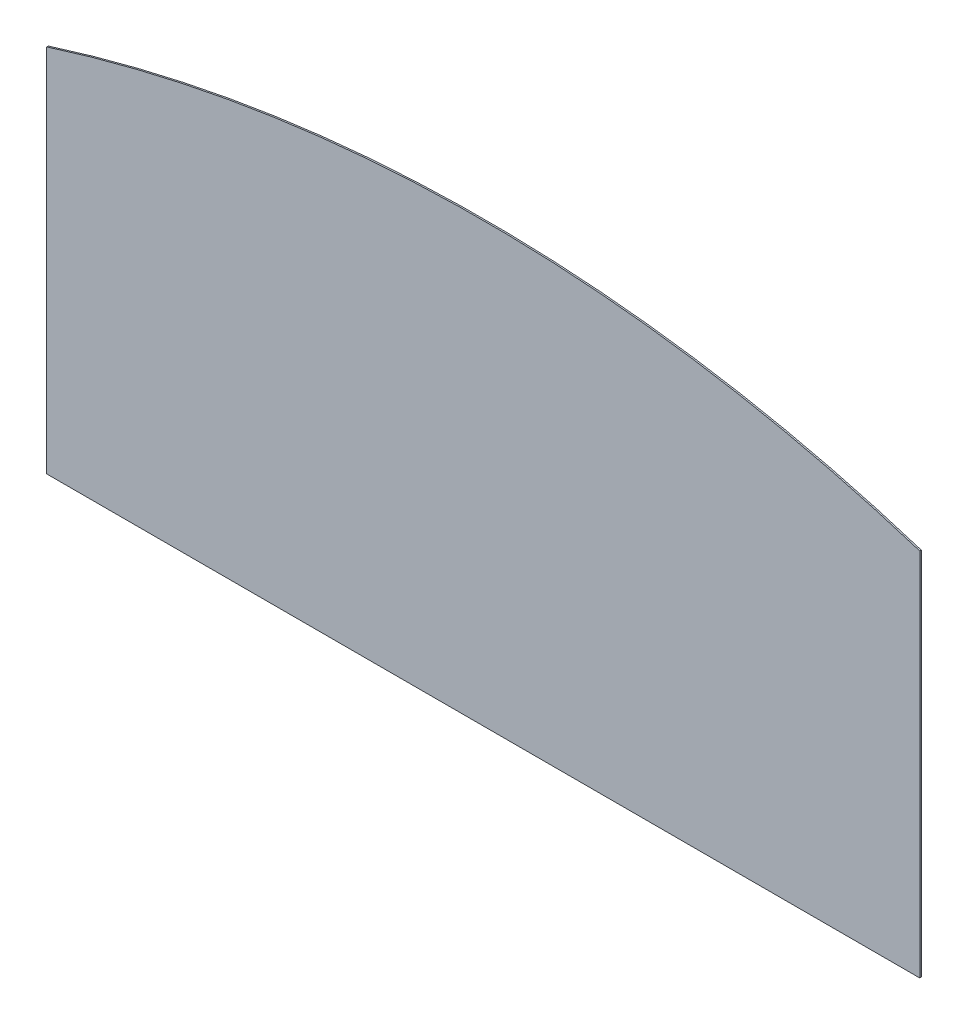
ISO-10303-21;
HEADER;
FILE_DESCRIPTION(('STEP AP214'),'2;1');
FILE_NAME('part.step','',(''),(''),'','','');
FILE_SCHEMA(('AUTOMOTIVE_DESIGN { 1 0 10303 214 1 1 1 1 }'));
ENDSEC;
DATA;
#1=APPLICATION_CONTEXT('core data for automotive mechanical design processes');
#2=APPLICATION_PROTOCOL_DEFINITION('international standard','automotive_design',2000,#1);
#3=PRODUCT_CONTEXT('',#1,'mechanical');
#4=PRODUCT('Part','Part','',(#3));
#5=PRODUCT_RELATED_PRODUCT_CATEGORY('part','',(#4));
#6=PRODUCT_DEFINITION_FORMATION('','',#4);
#7=PRODUCT_DEFINITION_CONTEXT('part definition',#1,'design');
#8=PRODUCT_DEFINITION('design','',#6,#7);
#9=PRODUCT_DEFINITION_SHAPE('','',#8);
#10=(LENGTH_UNIT() NAMED_UNIT(*) SI_UNIT(.MILLI.,.METRE.));
#11=(NAMED_UNIT(*) PLANE_ANGLE_UNIT() SI_UNIT($,.RADIAN.));
#12=(NAMED_UNIT(*) SI_UNIT($,.STERADIAN.) SOLID_ANGLE_UNIT());
#13=UNCERTAINTY_MEASURE_WITH_UNIT(LENGTH_MEASURE(1.E-05),#10,'distance_accuracy_value','');
#14=(GEOMETRIC_REPRESENTATION_CONTEXT(3) GLOBAL_UNCERTAINTY_ASSIGNED_CONTEXT((#13)) GLOBAL_UNIT_ASSIGNED_CONTEXT((#10,
#11,#12)) REPRESENTATION_CONTEXT('',''));
#15=CARTESIAN_POINT('',(0.,0.,0.));
#16=DIRECTION('',(0.,0.,1.));
#17=DIRECTION('',(1.,0.,0.));
#18=AXIS2_PLACEMENT_3D('',#15,#16,#17);
#19=CARTESIAN_POINT('',(0.,0.,6.35));
#20=DIRECTION('',(1.,0.,0.));
#21=DIRECTION('',(0.,0.,-1.));
#22=AXIS2_PLACEMENT_3D('',#19,#20,#21);
#23=PLANE('',#22);
#24=DIRECTION('',(0.,-1.,0.));
#25=VECTOR('',#24,1.);
#26=CARTESIAN_POINT('',(0.,0.,0.));
#27=LINE('',#26,#25);
#28=CARTESIAN_POINT('',(0.,1549.4,0.));
#29=VERTEX_POINT('',#28);
#30=CARTESIAN_POINT('',(0.,0.,0.));
#31=VERTEX_POINT('',#30);
#32=EDGE_CURVE('E97',#29,#31,#27,.T.);
#33=ORIENTED_EDGE('',*,*,#32,.T.);
#34=DIRECTION('',(0.,0.,-1.));
#35=VECTOR('',#34,1.);
#36=CARTESIAN_POINT('',(0.,0.,6.35));
#37=LINE('',#36,#35);
#38=CARTESIAN_POINT('',(0.,0.,6.35));
#39=VERTEX_POINT('',#38);
#40=EDGE_CURVE('E11',#39,#31,#37,.T.);
#41=ORIENTED_EDGE('',*,*,#40,.F.);
#42=DIRECTION('',(0.,-1.,0.));
#43=VECTOR('',#42,1.);
#44=CARTESIAN_POINT('',(0.,0.,6.35));
#45=LINE('',#44,#43);
#46=CARTESIAN_POINT('',(0.,1549.4,6.35));
#47=VERTEX_POINT('',#46);
#48=EDGE_CURVE('E85',#47,#39,#45,.T.);
#49=ORIENTED_EDGE('',*,*,#48,.F.);
#50=DIRECTION('',(0.,0.,-1.));
#51=VECTOR('',#50,1.);
#52=CARTESIAN_POINT('',(0.,1549.4,6.35));
#53=LINE('',#52,#51);
#54=EDGE_CURVE('E93',#47,#29,#53,.T.);
#55=ORIENTED_EDGE('',*,*,#54,.T.);
#56=EDGE_LOOP('',(#33,#41,#49,#55));
#57=FACE_BOUND('',#56,.T.);
#58=ADVANCED_FACE('F34',(#57),#23,.F.);
#59=CARTESIAN_POINT('',(0.,0.,6.35));
#60=DIRECTION('',(0.,1.,0.));
#61=DIRECTION('',(0.,0.,1.));
#62=AXIS2_PLACEMENT_3D('',#59,#60,#61);
#63=PLANE('',#62);
#64=DIRECTION('',(1.,0.,0.));
#65=VECTOR('',#64,1.);
#66=CARTESIAN_POINT('',(0.,0.,0.));
#67=LINE('',#66,#65);
#68=CARTESIAN_POINT('',(3657.6,0.,0.));
#69=VERTEX_POINT('',#68);
#70=EDGE_CURVE('E89',#31,#69,#67,.T.);
#71=ORIENTED_EDGE('',*,*,#70,.T.);
#72=DIRECTION('',(0.,0.,-1.));
#73=VECTOR('',#72,1.);
#74=CARTESIAN_POINT('',(3657.6,0.,6.35));
#75=LINE('',#74,#73);
#76=CARTESIAN_POINT('',(3657.6,0.,6.35));
#77=VERTEX_POINT('',#76);
#78=EDGE_CURVE('E42',#77,#69,#75,.T.);
#79=ORIENTED_EDGE('',*,*,#78,.F.);
#80=DIRECTION('',(1.,0.,0.));
#81=VECTOR('',#80,1.);
#82=CARTESIAN_POINT('',(0.,0.,6.35));
#83=LINE('',#82,#81);
#84=EDGE_CURVE('E80',#39,#77,#83,.T.);
#85=ORIENTED_EDGE('',*,*,#84,.F.);
#86=ORIENTED_EDGE('',*,*,#40,.T.);
#87=EDGE_LOOP('',(#71,#79,#85,#86));
#88=FACE_BOUND('',#87,.T.);
#89=ADVANCED_FACE('F88',(#88),#63,.F.);
#90=CARTESIAN_POINT('',(3657.6,0.,6.35));
#91=DIRECTION('',(-1.,0.,0.));
#92=DIRECTION('',(0.,0.,1.));
#93=AXIS2_PLACEMENT_3D('',#90,#91,#92);
#94=PLANE('',#93);
#95=DIRECTION('',(0.,1.,0.));
#96=VECTOR('',#95,1.);
#97=CARTESIAN_POINT('',(3657.6,0.,0.));
#98=LINE('',#97,#96);
#99=CARTESIAN_POINT('',(3657.6,1549.4,0.));
#100=VERTEX_POINT('',#99);
#101=EDGE_CURVE('E67',#69,#100,#98,.T.);
#102=ORIENTED_EDGE('',*,*,#101,.T.);
#103=DIRECTION('',(0.,0.,-1.));
#104=VECTOR('',#103,1.);
#105=CARTESIAN_POINT('',(3657.6,1549.4,6.35));
#106=LINE('',#105,#104);
#107=CARTESIAN_POINT('',(3657.6,1549.4,6.35));
#108=VERTEX_POINT('',#107);
#109=EDGE_CURVE('E90',#108,#100,#106,.T.);
#110=ORIENTED_EDGE('',*,*,#109,.F.);
#111=DIRECTION('',(0.,1.,0.));
#112=VECTOR('',#111,1.);
#113=CARTESIAN_POINT('',(3657.6,0.,6.35));
#114=LINE('',#113,#112);
#115=EDGE_CURVE('E83',#77,#108,#114,.T.);
#116=ORIENTED_EDGE('',*,*,#115,.F.);
#117=ORIENTED_EDGE('',*,*,#78,.T.);
#118=EDGE_LOOP('',(#102,#110,#116,#117));
#119=FACE_BOUND('',#118,.T.);
#120=ADVANCED_FACE('F91',(#119),#94,.F.);
#121=CARTESIAN_POINT('',(1828.8,-4175.03116589904,6.35));
#122=DIRECTION('',(0.,0.,-1.));
#123=DIRECTION('',(-1.,0.,0.));
#124=AXIS2_PLACEMENT_3D('',#121,#122,#123);
#125=CYLINDRICAL_SURFACE('',#124,6009.46100853615);
#126=CARTESIAN_POINT('',(1828.8,-4175.03116589904,0.));
#127=DIRECTION('',(0.,0.,1.));
#128=DIRECTION('',(-1.,0.,0.));
#129=AXIS2_PLACEMENT_3D('',#126,#127,#128);
#130=CIRCLE('',#129,6009.46100853615);
#131=EDGE_CURVE('E73',#100,#29,#130,.T.);
#132=ORIENTED_EDGE('',*,*,#131,.T.);
#133=ORIENTED_EDGE('',*,*,#54,.F.);
#134=CARTESIAN_POINT('',(1828.8,-4175.03116589904,6.35));
#135=DIRECTION('',(0.,0.,1.));
#136=DIRECTION('',(-1.,0.,0.));
#137=AXIS2_PLACEMENT_3D('',#134,#135,#136);
#138=CIRCLE('',#137,6009.46100853615);
#139=EDGE_CURVE('E50',#108,#47,#138,.T.);
#140=ORIENTED_EDGE('',*,*,#139,.F.);
#141=ORIENTED_EDGE('',*,*,#109,.T.);
#142=EDGE_LOOP('',(#132,#133,#140,#141));
#143=FACE_BOUND('',#142,.T.);
#144=ADVANCED_FACE('F104',(#143),#125,.T.);
#145=CARTESIAN_POINT('',(1828.8,-4175.03116589904,6.35));
#146=DIRECTION('',(0.,0.,-1.));
#147=DIRECTION('',(-1.,0.,0.));
#148=AXIS2_PLACEMENT_3D('',#145,#146,#147);
#149=PLANE('',#148);
#150=ORIENTED_EDGE('',*,*,#48,.T.);
#151=ORIENTED_EDGE('',*,*,#84,.T.);
#152=ORIENTED_EDGE('',*,*,#115,.T.);
#153=ORIENTED_EDGE('',*,*,#139,.T.);
#154=EDGE_LOOP('',(#150,#151,#152,#153));
#155=FACE_BOUND('',#154,.T.);
#156=ADVANCED_FACE('F81',(#155),#149,.F.);
#157=CARTESIAN_POINT('',(1828.8,-4175.03116589904,0.));
#158=DIRECTION('',(0.,0.,-1.));
#159=DIRECTION('',(-1.,0.,0.));
#160=AXIS2_PLACEMENT_3D('',#157,#158,#159);
#161=PLANE('',#160);
#162=ORIENTED_EDGE('',*,*,#32,.F.);
#163=ORIENTED_EDGE('',*,*,#131,.F.);
#164=ORIENTED_EDGE('',*,*,#101,.F.);
#165=ORIENTED_EDGE('',*,*,#70,.F.);
#166=EDGE_LOOP('',(#162,#163,#164,#165));
#167=FACE_BOUND('',#166,.T.);
#168=ADVANCED_FACE('F107',(#167),#161,.T.);
#169=CLOSED_SHELL('',(#58,#89,#120,#144,#156,#168));
#170=MANIFOLD_SOLID_BREP('B2',#169);
#171=ADVANCED_BREP_SHAPE_REPRESENTATION('',(#18,#170),#14);
#172=SHAPE_DEFINITION_REPRESENTATION(#9,#171);
ENDSEC;
END-ISO-10303-21;
